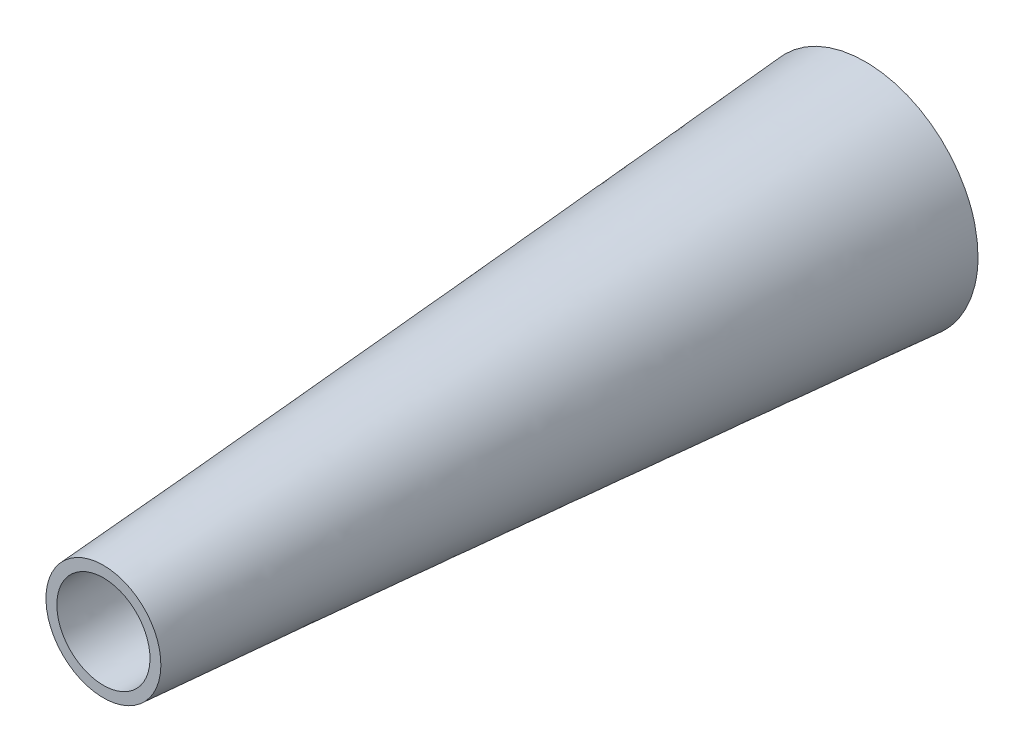
ISO-10303-21;
HEADER;
FILE_DESCRIPTION(('STEP AP214'),'2;1');
FILE_NAME('part.step','',(''),(''),'','','');
FILE_SCHEMA(('AUTOMOTIVE_DESIGN { 1 0 10303 214 1 1 1 1 }'));
ENDSEC;
DATA;
#1=APPLICATION_CONTEXT('core data for automotive mechanical design processes');
#2=APPLICATION_PROTOCOL_DEFINITION('international standard','automotive_design',2000,#1);
#3=PRODUCT_CONTEXT('',#1,'mechanical');
#4=PRODUCT('Part','Part','',(#3));
#5=PRODUCT_RELATED_PRODUCT_CATEGORY('part','',(#4));
#6=PRODUCT_DEFINITION_FORMATION('','',#4);
#7=PRODUCT_DEFINITION_CONTEXT('part definition',#1,'design');
#8=PRODUCT_DEFINITION('design','',#6,#7);
#9=PRODUCT_DEFINITION_SHAPE('','',#8);
#10=(LENGTH_UNIT() NAMED_UNIT(*) SI_UNIT(.MILLI.,.METRE.));
#11=(NAMED_UNIT(*) PLANE_ANGLE_UNIT() SI_UNIT($,.RADIAN.));
#12=(NAMED_UNIT(*) SI_UNIT($,.STERADIAN.) SOLID_ANGLE_UNIT());
#13=UNCERTAINTY_MEASURE_WITH_UNIT(LENGTH_MEASURE(1.E-05),#10,'distance_accuracy_value','');
#14=(GEOMETRIC_REPRESENTATION_CONTEXT(3) GLOBAL_UNCERTAINTY_ASSIGNED_CONTEXT((#13)) GLOBAL_UNIT_ASSIGNED_CONTEXT((#10,
#11,#12)) REPRESENTATION_CONTEXT('',''));
#15=CARTESIAN_POINT('',(0.,0.,0.));
#16=DIRECTION('',(0.,0.,1.));
#17=DIRECTION('',(1.,0.,0.));
#18=AXIS2_PLACEMENT_3D('',#15,#16,#17);
#19=CARTESIAN_POINT('',(0.,0.,100.));
#20=DIRECTION('',(0.,0.,1.));
#21=DIRECTION('',(1.,0.,0.));
#22=AXIS2_PLACEMENT_3D('',#19,#20,#21);
#23=PLANE('',#22);
#24=CARTESIAN_POINT('',(0.,0.,100.));
#25=DIRECTION('',(0.,0.,1.));
#26=DIRECTION('',(1.,0.,0.));
#27=AXIS2_PLACEMENT_3D('',#24,#25,#26);
#28=CIRCLE('',#27,10.7);
#29=CARTESIAN_POINT('',(-5.01872818350662,9.44999298518662,100.));
#30=VERTEX_POINT('',#29);
#31=EDGE_CURVE('E121',#30,#30,#28,.T.);
#32=ORIENTED_EDGE('',*,*,#31,.F.);
#33=EDGE_LOOP('',(#32));
#34=FACE_BOUND('',#33,.T.);
#35=CARTESIAN_POINT('',(0.,0.,100.));
#36=DIRECTION('',(0.,0.,1.));
#37=DIRECTION('',(1.,0.,0.));
#38=AXIS2_PLACEMENT_3D('',#35,#36,#37);
#39=CIRCLE('',#38,13.2);
#40=CARTESIAN_POINT('',(-10.1123789750657,8.48409049130481,100.));
#41=VERTEX_POINT('',#40);
#42=EDGE_CURVE('E11',#41,#41,#39,.T.);
#43=ORIENTED_EDGE('',*,*,#42,.T.);
#44=EDGE_LOOP('',(#43));
#45=FACE_BOUND('',#44,.T.);
#46=ADVANCED_FACE('F43',(#34,#45),#23,.T.);
#47=CARTESIAN_POINT('',(0.,0.,-75.));
#48=DIRECTION('',(0.,0.,1.));
#49=DIRECTION('',(1.,0.,0.));
#50=AXIS2_PLACEMENT_3D('',#47,#48,#49);
#51=PLANE('',#50);
#52=CARTESIAN_POINT('',(0.,0.,-75.));
#53=DIRECTION('',(0.,0.,-1.));
#54=DIRECTION('',(-1.,0.,0.));
#55=AXIS2_PLACEMENT_3D('',#52,#53,#54);
#56=CIRCLE('',#55,23.4);
#57=CARTESIAN_POINT('',(-23.0310445932316,-4.13895940359115,-75.));
#58=VERTEX_POINT('',#57);
#59=EDGE_CURVE('E56',#58,#58,#56,.T.);
#60=ORIENTED_EDGE('',*,*,#59,.F.);
#61=EDGE_LOOP('',(#60));
#62=FACE_BOUND('',#61,.T.);
#63=CARTESIAN_POINT('',(0.,0.,-75.));
#64=DIRECTION('',(0.,0.,1.));
#65=DIRECTION('',(1.,0.,0.));
#66=AXIS2_PLACEMENT_3D('',#63,#64,#65);
#67=CIRCLE('',#66,25.9);
#68=CARTESIAN_POINT('',(-23.7047463708818,10.4352766849839,-75.));
#69=VERTEX_POINT('',#68);
#70=EDGE_CURVE('E51',#69,#69,#67,.T.);
#71=ORIENTED_EDGE('',*,*,#70,.F.);
#72=EDGE_LOOP('',(#71));
#73=FACE_BOUND('',#72,.T.);
#74=ADVANCED_FACE('F75',(#62,#73),#51,.F.);
#75=CARTESIAN_POINT('',(-23.7047463708818,10.4352766849839,-75.));
#76=CARTESIAN_POINT('',(-10.1123789750657,8.48409049130481,100.));
#77=CARTESIAN_POINT('',(-44.5752997408495,-36.9742160567797,-75.));
#78=CARTESIAN_POINT('',(-27.0805599576753,-11.7406674588266,100.));
#79=CARTESIAN_POINT('',(2.83419300091406,-57.8447694267474,-75.));
#80=CARTESIAN_POINT('',(-6.8558020075439,-28.7088484414362,100.));
#81=CARTESIAN_POINT('',(23.7047463708818,-10.4352766849838,-75.));
#82=CARTESIAN_POINT('',(10.1123789750657,-8.48409049130481,100.));
#83=CARTESIAN_POINT('',(44.5752997408495,36.9742160567797,-75.));
#84=CARTESIAN_POINT('',(27.0805599576753,11.7406674588266,100.));
#85=CARTESIAN_POINT('',(-2.83419300091409,57.8447694267474,-75.));
#86=CARTESIAN_POINT('',(6.8558020075439,28.7088484414363,100.));
#87=CARTESIAN_POINT('',(-23.7047463708818,10.4352766849839,-75.));
#88=CARTESIAN_POINT('',(-10.1123789750657,8.48409049130481,100.));
#89=(BOUNDED_SURFACE() B_SPLINE_SURFACE(3,1,((#75,#76),(#77,#78),(#79,#80),(#81,#82),(#83,#84),
(#85,#86),(#87,#88)),.UNSPECIFIED.,.T.,.F.,.F.) B_SPLINE_SURFACE_WITH_KNOTS((4,3,4),(2,2),(0.,
0.5,1.),(0.,1.),.UNSPECIFIED.) GEOMETRIC_REPRESENTATION_ITEM() RATIONAL_B_SPLINE_SURFACE(((1.,
1.),(0.333333333333333,0.333333333333334),(0.333333333333333,0.333333333333334),(1.,1.),
(0.333333333333333,0.333333333333333),(0.333333333333333,0.333333333333333),(1.,1.))) REPRESENTATION_ITEM('') SURFACE());
#90=CARTESIAN_POINT('',(-23.7047463708818,10.4352766849839,-75.));
#91=CARTESIAN_POINT('',(-23.5631592105087,10.4149518287997,-73.1770833333333));
#92=CARTESIAN_POINT('',(-23.4215720501356,10.3946269726156,-71.3541666666667));
#93=CARTESIAN_POINT('',(-23.1383977293894,10.3539772602472,-67.7083333333333));
#94=CARTESIAN_POINT('',(-22.9968105690163,10.3336524040631,-65.8854166666667));
#95=CARTESIAN_POINT('',(-22.7136362482702,10.2930026916948,-62.2395833333333));
#96=CARTESIAN_POINT('',(-22.5720490878971,10.2726778355106,-60.4166666666667));
#97=CARTESIAN_POINT('',(-22.2888747671509,10.2320281231423,-56.7708333333333));
#98=CARTESIAN_POINT('',(-22.1472876067778,10.2117032669581,-54.9479166666667));
#99=CARTESIAN_POINT('',(-21.8641132860317,10.1710535545898,-51.3020833333333));
#100=CARTESIAN_POINT('',(-21.7225261256586,10.1507286984057,-49.4791666666667));
#101=CARTESIAN_POINT('',(-21.4393518049124,10.1100789860374,-45.8333333333333));
#102=CARTESIAN_POINT('',(-21.2977646445393,10.0897541298532,-44.0104166666667));
#103=CARTESIAN_POINT('',(-21.0145903237932,10.0491044174849,-40.3645833333333));
#104=CARTESIAN_POINT('',(-20.8730031634201,10.0287795613007,-38.5416666666667));
#105=CARTESIAN_POINT('',(-20.5898288426739,9.98812984893242,-34.8958333333333));
#106=CARTESIAN_POINT('',(-20.4482416823008,9.96780499274826,-33.0729166666667));
#107=CARTESIAN_POINT('',(-20.1650673615547,9.92715528037994,-29.4270833333333));
#108=CARTESIAN_POINT('',(-20.0234802011816,9.90683042419579,-27.6041666666667));
#109=CARTESIAN_POINT('',(-19.7403058804354,9.86618071182747,-23.9583333333333));
#110=CARTESIAN_POINT('',(-19.5987187200623,9.84585585564332,-22.1354166666667));
#111=CARTESIAN_POINT('',(-19.3155443993162,9.805206143275,-18.4895833333333));
#112=CARTESIAN_POINT('',(-19.1739572389431,9.78488128709085,-16.6666666666667));
#113=CARTESIAN_POINT('',(-18.8907829181969,9.74423157472253,-13.0208333333333));
#114=CARTESIAN_POINT('',(-18.7491957578238,9.72390671853838,-11.1979166666667));
#115=CARTESIAN_POINT('',(-18.4660214370777,9.68325700617006,-7.55208333333333));
#116=CARTESIAN_POINT('',(-18.3244342767046,9.66293214998591,-5.72916666666666));
#117=CARTESIAN_POINT('',(-18.0412599559584,9.62228243761759,-2.08333333333333));
#118=CARTESIAN_POINT('',(-17.8996727955853,9.60195758143344,-0.260416666666662));
#119=CARTESIAN_POINT('',(-17.6164984748392,9.56130786906512,3.38541666666667));
#120=CARTESIAN_POINT('',(-17.4749113144661,9.54098301288097,5.20833333333334));
#121=CARTESIAN_POINT('',(-17.1917369937199,9.50033330051265,8.85416666666667));
#122=CARTESIAN_POINT('',(-17.0501498333468,9.4800084443285,10.6770833333333));
#123=CARTESIAN_POINT('',(-16.7669755126007,9.43935873196018,14.3229166666667));
#124=CARTESIAN_POINT('',(-16.6253883522276,9.41903387577602,16.1458333333333));
#125=CARTESIAN_POINT('',(-16.3422140314814,9.37838416340771,19.7916666666667));
#126=CARTESIAN_POINT('',(-16.2006268711083,9.35805930722355,21.6145833333333));
#127=CARTESIAN_POINT('',(-15.9174525503622,9.31740959485524,25.2604166666667));
#128=CARTESIAN_POINT('',(-15.7758653899891,9.29708473867108,27.0833333333333));
#129=CARTESIAN_POINT('',(-15.4926910692429,9.25643502630277,30.7291666666667));
#130=CARTESIAN_POINT('',(-15.3511039088698,9.23611017011861,32.5520833333333));
#131=CARTESIAN_POINT('',(-15.0679295881237,9.1954604577503,36.1979166666667));
#132=CARTESIAN_POINT('',(-14.9263424277506,9.17513560156614,38.0208333333333));
#133=CARTESIAN_POINT('',(-14.6431681070044,9.13448588919783,41.6666666666667));
#134=CARTESIAN_POINT('',(-14.5015809466313,9.11416103301367,43.4895833333333));
#135=CARTESIAN_POINT('',(-14.2184066258852,9.07351132064536,47.1354166666667));
#136=CARTESIAN_POINT('',(-14.0768194655121,9.0531864644612,48.9583333333333));
#137=CARTESIAN_POINT('',(-13.7936451447659,9.01253675209289,52.6041666666667));
#138=CARTESIAN_POINT('',(-13.6520579843928,8.99221189590873,54.4270833333333));
#139=CARTESIAN_POINT('',(-13.3688836636467,8.95156218354042,58.0729166666667));
#140=CARTESIAN_POINT('',(-13.2272965032736,8.93123732735626,59.8958333333333));
#141=CARTESIAN_POINT('',(-12.9441221825274,8.89058761498795,63.5416666666667));
#142=CARTESIAN_POINT('',(-12.8025350221543,8.87026275880379,65.3645833333333));
#143=CARTESIAN_POINT('',(-12.5193607014082,8.82961304643548,69.0104166666667));
#144=CARTESIAN_POINT('',(-12.3777735410351,8.80928819025132,70.8333333333333));
#145=CARTESIAN_POINT('',(-12.0945992202889,8.76863847788301,74.4791666666667));
#146=CARTESIAN_POINT('',(-11.9530120599158,8.74831362169885,76.3020833333333));
#147=CARTESIAN_POINT('',(-11.6698377391696,8.70766390933053,79.9479166666667));
#148=CARTESIAN_POINT('',(-11.5282505787966,8.68733905314638,81.7708333333333));
#149=CARTESIAN_POINT('',(-11.2450762580504,8.64668934077806,85.4166666666667));
#150=CARTESIAN_POINT('',(-11.1034890976773,8.62636448459391,87.2395833333333));
#151=CARTESIAN_POINT('',(-10.8203147769311,8.58571477222559,90.8854166666667));
#152=CARTESIAN_POINT('',(-10.6787276165581,8.56538991604144,92.7083333333333));
#153=CARTESIAN_POINT('',(-10.3955532958119,8.52474020367312,96.3541666666667));
#154=CARTESIAN_POINT('',(-10.2539661354388,8.50441534748897,98.1770833333333));
#155=CARTESIAN_POINT('',(-10.1123789750657,8.48409049130481,100.));
#156=B_SPLINE_CURVE_WITH_KNOTS('',3,(#90,#91,#92,#93,#94,#95,#96,#97,#98,#99,#100,#101,#102,
#103,#104,#105,#106,#107,#108,#109,#110,#111,#112,#113,#114,#115,#116,#117,#118,#119,#120,#121,
#122,#123,#124,#125,#126,#127,#128,#129,#130,#131,#132,#133,#134,#135,#136,#137,#138,#139,#140,
#141,#142,#143,#144,#145,#146,#147,#148,#149,#150,#151,#152,#153,#154,#155),.UNSPECIFIED.,.F.,
.F.,(4,2,2,2,2,2,2,2,2,2,2,2,2,2,2,2,2,2,2,2,2,2,2,2,2,2,2,2,2,2,2,2,4),(0.,5.48555984165271,
10.9711196833054,16.4566795249581,21.9422393666108,27.4277992082635,32.9133590499162,
38.3989188915689,43.8844787332216,49.3700385748743,54.855598416527,60.3411582581797,
65.8267180998324,71.3122779414851,76.7978377831378,82.2833976247905,87.7689574664432,
93.2545173080959,98.7400771497486,104.225636991401,109.711196833054,115.196756674707,
120.682316516359,126.167876358012,131.653436199665,137.138996041317,142.62455588297,
148.110115724623,153.595675566276,159.081235407928,164.566795249581,170.052355091234,
175.537914932886),.UNSPECIFIED.);
#157=EDGE_CURVE('BSEAM84',#69,#41,#156,.T.);
#158=ORIENTED_EDGE('',*,*,#70,.T.);
#159=ORIENTED_EDGE('',*,*,#42,.F.);
#160=ORIENTED_EDGE('',*,*,#157,.T.);
#161=ORIENTED_EDGE('',*,*,#157,.F.);
#162=EDGE_LOOP('',(#158,#160,#159,#161));
#163=FACE_BOUND('',#162,.T.);
#164=ADVANCED_FACE('F84',(#163),#89,.T.);
#165=CARTESIAN_POINT('',(-5.01872818350662,9.44999298518662,100.));
#166=CARTESIAN_POINT('',(-23.0310445932316,-4.13895940359115,-75.));
#167=CARTESIAN_POINT('',(13.8812577868666,19.4874493521999,100.));
#168=CARTESIAN_POINT('',(-31.3089634004139,41.9231297828722,-75.));
#169=CARTESIAN_POINT('',(23.9187141538799,0.587463381826617,100.));
#170=CARTESIAN_POINT('',(14.7531257860494,50.2010485900545,-75.));
#171=CARTESIAN_POINT('',(5.01872818350662,-9.44999298518662,100.));
#172=CARTESIAN_POINT('',(23.0310445932316,4.13895940359113,-75.));
#173=CARTESIAN_POINT('',(-13.8812577868666,-19.4874493521999,100.));
#174=CARTESIAN_POINT('',(31.3089634004139,-41.9231297828721,-75.));
#175=CARTESIAN_POINT('',(-23.9187141538799,-0.587463381826615,100.));
#176=CARTESIAN_POINT('',(-14.7531257860494,-50.2010485900544,-75.));
#177=CARTESIAN_POINT('',(-5.01872818350662,9.44999298518662,100.));
#178=CARTESIAN_POINT('',(-23.0310445932316,-4.13895940359115,-75.));
#179=(BOUNDED_SURFACE() B_SPLINE_SURFACE(3,1,((#165,#166),(#167,#168),(#169,#170),(#171,#172),
(#173,#174),(#175,#176),(#177,#178)),.UNSPECIFIED.,.T.,.F.,.F.) B_SPLINE_SURFACE_WITH_KNOTS((4,
3,4),(2,2),(0.,0.5,1.),(0.,1.),
.UNSPECIFIED.) GEOMETRIC_REPRESENTATION_ITEM() RATIONAL_B_SPLINE_SURFACE(((1.,1.),
(0.333333333333333,0.333333333333333),(0.333333333333333,0.333333333333333),(1.,1.),
(0.333333333333333,0.333333333333333),(0.333333333333333,0.333333333333333),(1.,1.))) REPRESENTATION_ITEM('') SURFACE());
#180=CARTESIAN_POINT('',(-5.01872818350662,9.44999298518662,100.));
#181=CARTESIAN_POINT('',(-5.20635647944126,9.30844139780352,98.1770833333333));
#182=CARTESIAN_POINT('',(-5.39398477537589,9.16688981042042,96.3541666666667));
#183=CARTESIAN_POINT('',(-5.76924136724516,8.88378663565421,92.7083333333333));
#184=CARTESIAN_POINT('',(-5.9568696631798,8.74223504827111,90.8854166666667));
#185=CARTESIAN_POINT('',(-6.33212625504907,8.45913187350491,87.2395833333333));
#186=CARTESIAN_POINT('',(-6.51975455098371,8.31758028612181,85.4166666666667));
#187=CARTESIAN_POINT('',(-6.89501114285298,8.0344771113556,81.7708333333333));
#188=CARTESIAN_POINT('',(-7.08263943878761,7.8929255239725,79.9479166666667));
#189=CARTESIAN_POINT('',(-7.45789603065688,7.6098223492063,76.3020833333333));
#190=CARTESIAN_POINT('',(-7.64552432659152,7.4682707618232,74.4791666666667));
#191=CARTESIAN_POINT('',(-8.02078091846079,7.18516758705699,70.8333333333333));
#192=CARTESIAN_POINT('',(-8.20840921439543,7.04361599967389,69.0104166666667));
#193=CARTESIAN_POINT('',(-8.5836658062647,6.76051282490769,65.3645833333333));
#194=CARTESIAN_POINT('',(-8.77129410219933,6.61896123752458,63.5416666666667));
#195=CARTESIAN_POINT('',(-9.1465506940686,6.33585806275838,59.8958333333333));
#196=CARTESIAN_POINT('',(-9.33417899000324,6.19430647537528,58.0729166666667));
#197=CARTESIAN_POINT('',(-9.70943558187251,5.91120330060908,54.4270833333333));
#198=CARTESIAN_POINT('',(-9.89706387780715,5.76965171322597,52.6041666666667));
#199=CARTESIAN_POINT('',(-10.2723204696764,5.48654853845977,48.9583333333333));
#200=CARTESIAN_POINT('',(-10.4599487656111,5.34499695107667,47.1354166666667));
#201=CARTESIAN_POINT('',(-10.8352053574803,5.06189377631047,43.4895833333333));
#202=CARTESIAN_POINT('',(-11.022833653415,4.92034218892736,41.6666666666667));
#203=CARTESIAN_POINT('',(-11.3980902452842,4.63723901416116,38.0208333333333));
#204=CARTESIAN_POINT('',(-11.5857185412189,4.49568742677806,36.1979166666667));
#205=CARTESIAN_POINT('',(-11.9609751330881,4.21258425201185,32.5520833333333));
#206=CARTESIAN_POINT('',(-12.1486034290228,4.07103266462875,30.7291666666667));
#207=CARTESIAN_POINT('',(-12.523860020892,3.78792948986255,27.0833333333333));
#208=CARTESIAN_POINT('',(-12.7114883168267,3.64637790247945,25.2604166666667));
#209=CARTESIAN_POINT('',(-13.086744908696,3.36327472771324,21.6145833333333));
#210=CARTESIAN_POINT('',(-13.2743732046306,3.22172314033014,19.7916666666667));
#211=CARTESIAN_POINT('',(-13.6496297964999,2.93861996556394,16.1458333333333));
#212=CARTESIAN_POINT('',(-13.8372580924345,2.79706837818084,14.3229166666667));
#213=CARTESIAN_POINT('',(-14.2125146843038,2.51396520341463,10.6770833333333));
#214=CARTESIAN_POINT('',(-14.4001429802384,2.37241361603153,8.85416666666667));
#215=CARTESIAN_POINT('',(-14.7753995721077,2.08931044126533,5.20833333333334));
#216=CARTESIAN_POINT('',(-14.9630278680423,1.94775885388223,3.38541666666667));
#217=CARTESIAN_POINT('',(-15.3382844599116,1.66465567911602,-0.260416666666661));
#218=CARTESIAN_POINT('',(-15.5259127558462,1.52310409173292,-2.08333333333333));
#219=CARTESIAN_POINT('',(-15.9011693477155,1.24000091696672,-5.72916666666666));
#220=CARTESIAN_POINT('',(-16.0887976436501,1.09844932958361,-7.55208333333333));
#221=CARTESIAN_POINT('',(-16.4640542355194,0.815346154817411,-11.1979166666667));
#222=CARTESIAN_POINT('',(-16.651682531454,0.673794567434309,-13.0208333333333));
#223=CARTESIAN_POINT('',(-17.0269391233233,0.390691392668106,-16.6666666666667));
#224=CARTESIAN_POINT('',(-17.2145674192579,0.249139805285004,-18.4895833333333));
#225=CARTESIAN_POINT('',(-17.5898240111272,-0.0339633694811999,-22.1354166666667));
#226=CARTESIAN_POINT('',(-17.7774523070618,-0.175514956864302,-23.9583333333333));
#227=CARTESIAN_POINT('',(-18.1527088989311,-0.458618131630505,-27.6041666666667));
#228=CARTESIAN_POINT('',(-18.3403371948658,-0.600169719013607,-29.4270833333333));
#229=CARTESIAN_POINT('',(-18.715593786735,-0.883272893779811,-33.0729166666667));
#230=CARTESIAN_POINT('',(-18.9032220826697,-1.02482448116291,-34.8958333333333));
#231=CARTESIAN_POINT('',(-19.2784786745389,-1.30792765592912,-38.5416666666667));
#232=CARTESIAN_POINT('',(-19.4661069704736,-1.44947924331222,-40.3645833333333));
#233=CARTESIAN_POINT('',(-19.8413635623428,-1.73258241807842,-44.0104166666667));
#234=CARTESIAN_POINT('',(-20.0289918582775,-1.87413400546152,-45.8333333333333));
#235=CARTESIAN_POINT('',(-20.4042484501467,-2.15723718022773,-49.4791666666667));
#236=CARTESIAN_POINT('',(-20.5918767460814,-2.29878876761083,-51.3020833333333));
#237=CARTESIAN_POINT('',(-20.9671333379506,-2.58189194237703,-54.9479166666667));
#238=CARTESIAN_POINT('',(-21.1547616338853,-2.72344352976013,-56.7708333333333));
#239=CARTESIAN_POINT('',(-21.5300182257546,-3.00654670452634,-60.4166666666667));
#240=CARTESIAN_POINT('',(-21.7176465216892,-3.14809829190944,-62.2395833333333));
#241=CARTESIAN_POINT('',(-22.0929031135585,-3.43120146667564,-65.8854166666667));
#242=CARTESIAN_POINT('',(-22.2805314094931,-3.57275305405874,-67.7083333333333));
#243=CARTESIAN_POINT('',(-22.6557880013624,-3.85585622882495,-71.3541666666667));
#244=CARTESIAN_POINT('',(-22.843416297297,-3.99740781620805,-73.1770833333333));
#245=CARTESIAN_POINT('',(-23.0310445932316,-4.13895940359115,-75.));
#246=B_SPLINE_CURVE_WITH_KNOTS('',3,(#180,#181,#182,#183,#184,#185,#186,#187,#188,#189,#190,
#191,#192,#193,#194,#195,#196,#197,#198,#199,#200,#201,#202,#203,#204,#205,#206,#207,#208,#209,
#210,#211,#212,#213,#214,#215,#216,#217,#218,#219,#220,#221,#222,#223,#224,#225,#226,#227,#228,
#229,#230,#231,#232,#233,#234,#235,#236,#237,#238,#239,#240,#241,#242,#243,#244,#245),
.UNSPECIFIED.,.F.,.F.,(4,2,2,2,2,2,2,2,2,2,2,2,2,2,2,2,2,2,2,2,2,2,2,2,2,2,2,2,2,2,2,2,4),(0.,
5.51401828310663,11.0280365662132,16.5420548493199,22.0560731324265,27.5700914155331,
33.0841096986397,38.5981279817464,44.112146264853,49.6261645479596,55.1401828310662,
60.6542011141728,66.1682193972795,71.6822376803861,77.1962559634927,82.7102742465993,
88.2242925297059,93.7383108128126,99.2523290959192,104.766347379026,110.280365662132,
115.794383945239,121.308402228346,126.822420511452,132.336438794559,137.850457077666,
143.364475360772,148.878493643879,154.392511926985,159.906530210092,165.420548493199,
170.934566776305,176.448585059412),.UNSPECIFIED.);
#247=EDGE_CURVE('BSEAM86',#30,#58,#246,.T.);
#248=ORIENTED_EDGE('',*,*,#31,.T.);
#249=ORIENTED_EDGE('',*,*,#59,.T.);
#250=ORIENTED_EDGE('',*,*,#247,.T.);
#251=ORIENTED_EDGE('',*,*,#247,.F.);
#252=EDGE_LOOP('',(#248,#250,#249,#251));
#253=FACE_BOUND('',#252,.T.);
#254=ADVANCED_FACE('F86',(#253),#179,.F.);
#255=CLOSED_SHELL('',(#46,#74,#164,#254));
#256=MANIFOLD_SOLID_BREP('B2',#255);
#257=ADVANCED_BREP_SHAPE_REPRESENTATION('',(#18,#256),#14);
#258=SHAPE_DEFINITION_REPRESENTATION(#9,#257);
ENDSEC;
END-ISO-10303-21;
